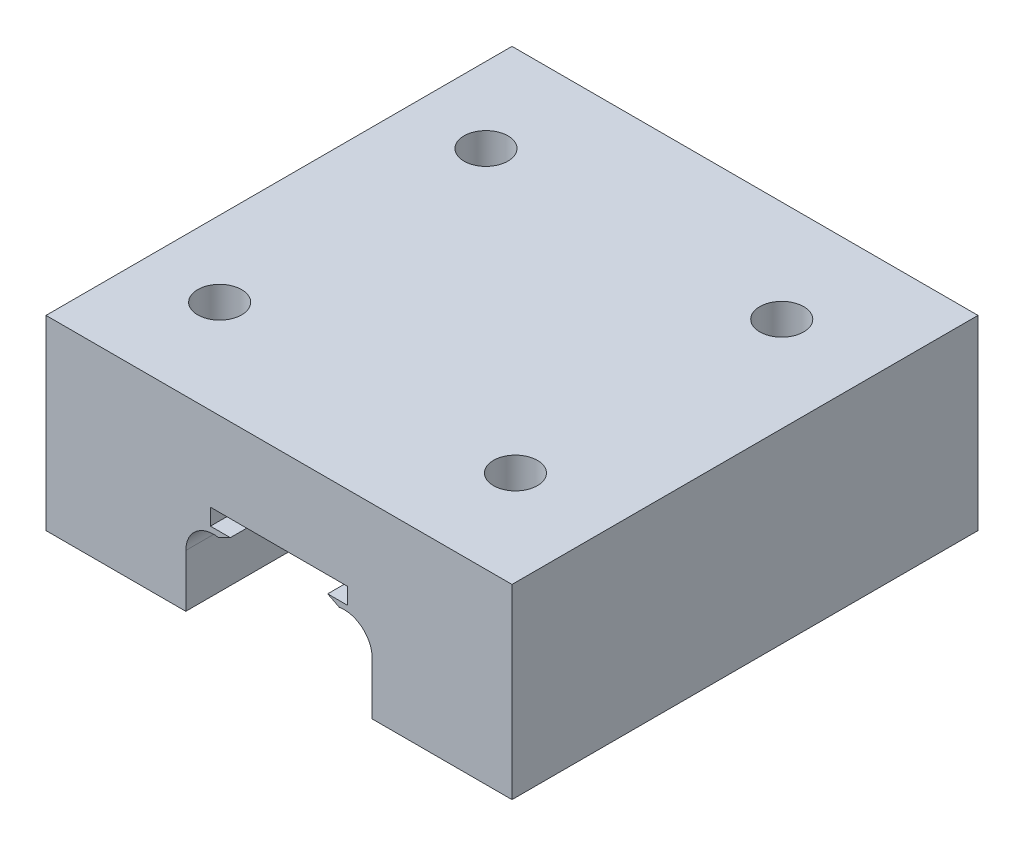
ISO-10303-21;
HEADER;
FILE_DESCRIPTION(('STEP AP214'),'2;1');
FILE_NAME('part.step','',(''),(''),'','','');
FILE_SCHEMA(('AUTOMOTIVE_DESIGN { 1 0 10303 214 1 1 1 1 }'));
ENDSEC;
DATA;
#1=APPLICATION_CONTEXT('core data for automotive mechanical design processes');
#2=APPLICATION_PROTOCOL_DEFINITION('international standard','automotive_design',2000,#1);
#3=PRODUCT_CONTEXT('',#1,'mechanical');
#4=PRODUCT('Part','Part','',(#3));
#5=PRODUCT_RELATED_PRODUCT_CATEGORY('part','',(#4));
#6=PRODUCT_DEFINITION_FORMATION('','',#4);
#7=PRODUCT_DEFINITION_CONTEXT('part definition',#1,'design');
#8=PRODUCT_DEFINITION('design','',#6,#7);
#9=PRODUCT_DEFINITION_SHAPE('','',#8);
#10=(LENGTH_UNIT() NAMED_UNIT(*) SI_UNIT(.MILLI.,.METRE.));
#11=(NAMED_UNIT(*) PLANE_ANGLE_UNIT() SI_UNIT($,.RADIAN.));
#12=(NAMED_UNIT(*) SI_UNIT($,.STERADIAN.) SOLID_ANGLE_UNIT());
#13=UNCERTAINTY_MEASURE_WITH_UNIT(LENGTH_MEASURE(1.E-05),#10,'distance_accuracy_value','');
#14=(GEOMETRIC_REPRESENTATION_CONTEXT(3) GLOBAL_UNCERTAINTY_ASSIGNED_CONTEXT((#13)) GLOBAL_UNIT_ASSIGNED_CONTEXT((#10,
#11,#12)) REPRESENTATION_CONTEXT('',''));
#15=CARTESIAN_POINT('',(0.,0.,0.));
#16=DIRECTION('',(0.,0.,1.));
#17=DIRECTION('',(1.,0.,0.));
#18=AXIS2_PLACEMENT_3D('',#15,#16,#17);
#19=CARTESIAN_POINT('',(-25.,0.,50.));
#20=DIRECTION('',(-1.,0.,0.));
#21=DIRECTION('',(0.,-1.,0.));
#22=AXIS2_PLACEMENT_3D('',#19,#20,#21);
#23=PLANE('',#22);
#24=DIRECTION('',(0.,1.,0.));
#25=VECTOR('',#24,1.);
#26=CARTESIAN_POINT('',(-25.,0.,0.));
#27=LINE('',#26,#25);
#28=CARTESIAN_POINT('',(-25.,0.,0.));
#29=VERTEX_POINT('',#28);
#30=CARTESIAN_POINT('',(-25.,20.,0.));
#31=VERTEX_POINT('',#30);
#32=EDGE_CURVE('E179',#29,#31,#27,.T.);
#33=ORIENTED_EDGE('',*,*,#32,.F.);
#34=DIRECTION('',(0.,0.,-1.));
#35=VECTOR('',#34,1.);
#36=CARTESIAN_POINT('',(-25.,0.,50.));
#37=LINE('',#36,#35);
#38=CARTESIAN_POINT('',(-25.,0.,50.));
#39=VERTEX_POINT('',#38);
#40=EDGE_CURVE('E11',#39,#29,#37,.T.);
#41=ORIENTED_EDGE('',*,*,#40,.F.);
#42=DIRECTION('',(0.,1.,0.));
#43=VECTOR('',#42,1.);
#44=CARTESIAN_POINT('',(-25.,0.,50.));
#45=LINE('',#44,#43);
#46=CARTESIAN_POINT('',(-25.,20.,50.));
#47=VERTEX_POINT('',#46);
#48=EDGE_CURVE('E218',#39,#47,#45,.T.);
#49=ORIENTED_EDGE('',*,*,#48,.T.);
#50=DIRECTION('',(0.,0.,-1.));
#51=VECTOR('',#50,1.);
#52=CARTESIAN_POINT('',(-25.,20.,50.));
#53=LINE('',#52,#51);
#54=EDGE_CURVE('E36',#47,#31,#53,.T.);
#55=ORIENTED_EDGE('',*,*,#54,.T.);
#56=EDGE_LOOP('',(#33,#41,#49,#55));
#57=FACE_BOUND('',#56,.T.);
#58=ADVANCED_FACE('F33',(#57),#23,.T.);
#59=CARTESIAN_POINT('',(-25.,0.,50.));
#60=DIRECTION('',(0.,1.,0.));
#61=DIRECTION('',(-1.,0.,0.));
#62=AXIS2_PLACEMENT_3D('',#59,#60,#61);
#63=PLANE('',#62);
#64=CARTESIAN_POINT('',(-16.9044142875379,0.,10.8891024318751));
#65=DIRECTION('',(0.,1.,0.));
#66=DIRECTION('',(-1.,0.,0.));
#67=AXIS2_PLACEMENT_3D('',#64,#65,#66);
#68=CIRCLE('',#67,2.35674785049616);
#69=CARTESIAN_POINT('',(-19.261162138034,0.,10.8891024318751));
#70=VERTEX_POINT('',#69);
#71=EDGE_CURVE('E308',#70,#70,#68,.T.);
#72=ORIENTED_EDGE('',*,*,#71,.T.);
#73=EDGE_LOOP('',(#72));
#74=FACE_BOUND('',#73,.T.);
#75=CARTESIAN_POINT('',(-16.9044142875379,0.,39.4617841158151));
#76=DIRECTION('',(0.,1.,0.));
#77=DIRECTION('',(-1.,0.,0.));
#78=AXIS2_PLACEMENT_3D('',#75,#76,#77);
#79=CIRCLE('',#78,2.35674785049615);
#80=CARTESIAN_POINT('',(-19.261162138034,0.,39.4617841158151));
#81=VERTEX_POINT('',#80);
#82=EDGE_CURVE('E302',#81,#81,#79,.T.);
#83=ORIENTED_EDGE('',*,*,#82,.T.);
#84=EDGE_LOOP('',(#83));
#85=FACE_BOUND('',#84,.T.);
#86=DIRECTION('',(1.,0.,0.));
#87=VECTOR('',#86,1.);
#88=CARTESIAN_POINT('',(-25.,0.,0.));
#89=LINE('',#88,#87);
#90=CARTESIAN_POINT('',(-10.,0.,0.));
#91=VERTEX_POINT('',#90);
#92=EDGE_CURVE('E102',#29,#91,#89,.T.);
#93=ORIENTED_EDGE('',*,*,#92,.T.);
#94=DIRECTION('',(0.,0.,-1.));
#95=VECTOR('',#94,1.);
#96=CARTESIAN_POINT('',(-10.,0.,50.));
#97=LINE('',#96,#95);
#98=CARTESIAN_POINT('',(-10.,0.,50.));
#99=VERTEX_POINT('',#98);
#100=EDGE_CURVE('E42',#99,#91,#97,.T.);
#101=ORIENTED_EDGE('',*,*,#100,.F.);
#102=DIRECTION('',(1.,0.,0.));
#103=VECTOR('',#102,1.);
#104=CARTESIAN_POINT('',(-25.,0.,50.));
#105=LINE('',#104,#103);
#106=EDGE_CURVE('E157',#39,#99,#105,.T.);
#107=ORIENTED_EDGE('',*,*,#106,.F.);
#108=ORIENTED_EDGE('',*,*,#40,.T.);
#109=EDGE_LOOP('',(#93,#101,#107,#108));
#110=FACE_BOUND('',#109,.T.);
#111=ADVANCED_FACE('F317',(#74,#85,#110),#63,.F.);
#112=CARTESIAN_POINT('',(-10.,0.,50.));
#113=DIRECTION('',(-1.,0.,0.));
#114=DIRECTION('',(0.,0.,1.));
#115=AXIS2_PLACEMENT_3D('',#112,#113,#114);
#116=PLANE('',#115);
#117=DIRECTION('',(0.,1.,0.));
#118=VECTOR('',#117,1.);
#119=CARTESIAN_POINT('',(-10.,0.,0.));
#120=LINE('',#119,#118);
#121=CARTESIAN_POINT('',(-10.,5.65605635574879,0.));
#122=VERTEX_POINT('',#121);
#123=EDGE_CURVE('E164',#91,#122,#120,.T.);
#124=ORIENTED_EDGE('',*,*,#123,.T.);
#125=DIRECTION('',(0.,0.,-1.));
#126=VECTOR('',#125,1.);
#127=CARTESIAN_POINT('',(-10.,5.65605635574879,50.));
#128=LINE('',#127,#126);
#129=CARTESIAN_POINT('',(-10.,5.65605635574879,50.));
#130=VERTEX_POINT('',#129);
#131=EDGE_CURVE('E161',#130,#122,#128,.T.);
#132=ORIENTED_EDGE('',*,*,#131,.F.);
#133=DIRECTION('',(0.,1.,0.));
#134=VECTOR('',#133,1.);
#135=CARTESIAN_POINT('',(-10.,0.,50.));
#136=LINE('',#135,#134);
#137=EDGE_CURVE('E150',#99,#130,#136,.T.);
#138=ORIENTED_EDGE('',*,*,#137,.F.);
#139=ORIENTED_EDGE('',*,*,#100,.T.);
#140=EDGE_LOOP('',(#124,#132,#138,#139));
#141=FACE_BOUND('',#140,.T.);
#142=ADVANCED_FACE('F162',(#141),#116,.F.);
#143=CARTESIAN_POINT('',(-7.00000000000001,5.65605635574879,50.));
#144=DIRECTION('',(0.,0.,-1.));
#145=DIRECTION('',(-1.,0.,0.));
#146=AXIS2_PLACEMENT_3D('',#143,#144,#145);
#147=CYLINDRICAL_SURFACE('',#146,3.);
#148=CARTESIAN_POINT('',(-7.00000000000001,5.65605635574879,0.));
#149=DIRECTION('',(0.,0.,-1.));
#150=DIRECTION('',(-1.,0.,0.));
#151=AXIS2_PLACEMENT_3D('',#148,#149,#150);
#152=CIRCLE('',#151,3.);
#153=CARTESIAN_POINT('',(-6.46154287587818,8.60733809856537,0.));
#154=VERTEX_POINT('',#153);
#155=EDGE_CURVE('E215',#122,#154,#152,.T.);
#156=ORIENTED_EDGE('',*,*,#155,.T.);
#157=DIRECTION('',(0.,0.,-1.));
#158=VECTOR('',#157,1.);
#159=CARTESIAN_POINT('',(-6.46154287587818,8.60733809856537,50.));
#160=LINE('',#159,#158);
#161=CARTESIAN_POINT('',(-6.46154287587818,8.60733809856537,50.));
#162=VERTEX_POINT('',#161);
#163=EDGE_CURVE('E167',#162,#154,#160,.T.);
#164=ORIENTED_EDGE('',*,*,#163,.F.);
#165=CARTESIAN_POINT('',(-7.00000000000001,5.65605635574879,50.));
#166=DIRECTION('',(0.,0.,-1.));
#167=DIRECTION('',(-1.,0.,0.));
#168=AXIS2_PLACEMENT_3D('',#165,#166,#167);
#169=CIRCLE('',#168,3.);
#170=EDGE_CURVE('E155',#130,#162,#169,.T.);
#171=ORIENTED_EDGE('',*,*,#170,.F.);
#172=ORIENTED_EDGE('',*,*,#131,.T.);
#173=EDGE_LOOP('',(#156,#164,#171,#172));
#174=FACE_BOUND('',#173,.T.);
#175=ADVANCED_FACE('F169',(#174),#147,.F.);
#176=CARTESIAN_POINT('',(-6.46154287587818,8.60733809856537,50.));
#177=DIRECTION('',(-0.452765463645249,0.891629651217422,0.));
#178=DIRECTION('',(-0.891629651217423,-0.45276546364525,0.));
#179=AXIS2_PLACEMENT_3D('',#176,#177,#178);
#180=PLANE('',#179);
#181=DIRECTION('',(0.891629651217423,0.45276546364525,0.));
#182=VECTOR('',#181,1.);
#183=CARTESIAN_POINT('',(-6.46154287587818,8.60733809856537,0.));
#184=LINE('',#183,#182);
#185=CARTESIAN_POINT('',(-5.22174404276978,9.2369022822292,0.));
#186=VERTEX_POINT('',#185);
#187=EDGE_CURVE('E213',#154,#186,#184,.T.);
#188=ORIENTED_EDGE('',*,*,#187,.T.);
#189=DIRECTION('',(0.,0.,-1.));
#190=VECTOR('',#189,1.);
#191=CARTESIAN_POINT('',(-5.22174404276978,9.2369022822292,50.));
#192=LINE('',#191,#190);
#193=CARTESIAN_POINT('',(-5.22174404276978,9.2369022822292,50.));
#194=VERTEX_POINT('',#193);
#195=EDGE_CURVE('E222',#194,#186,#192,.T.);
#196=ORIENTED_EDGE('',*,*,#195,.F.);
#197=DIRECTION('',(0.891629651217423,0.45276546364525,0.));
#198=VECTOR('',#197,1.);
#199=CARTESIAN_POINT('',(-6.46154287587818,8.60733809856537,50.));
#200=LINE('',#199,#198);
#201=EDGE_CURVE('E172',#162,#194,#200,.T.);
#202=ORIENTED_EDGE('',*,*,#201,.F.);
#203=ORIENTED_EDGE('',*,*,#163,.T.);
#204=EDGE_LOOP('',(#188,#196,#202,#203));
#205=FACE_BOUND('',#204,.T.);
#206=ADVANCED_FACE('F254',(#205),#180,.F.);
#207=CARTESIAN_POINT('',(-5.22174404276978,9.2369022822292,50.));
#208=DIRECTION('',(0.,-1.,0.));
#209=DIRECTION('',(1.,0.,0.));
#210=AXIS2_PLACEMENT_3D('',#207,#208,#209);
#211=PLANE('',#210);
#212=DIRECTION('',(-1.,0.,0.));
#213=VECTOR('',#212,1.);
#214=CARTESIAN_POINT('',(-5.22174404276978,9.2369022822292,0.));
#215=LINE('',#214,#213);
#216=CARTESIAN_POINT('',(-7.35481869295251,9.2369022822292,0.));
#217=VERTEX_POINT('',#216);
#218=EDGE_CURVE('E211',#186,#217,#215,.T.);
#219=ORIENTED_EDGE('',*,*,#218,.T.);
#220=DIRECTION('',(0.,0.,-1.));
#221=VECTOR('',#220,1.);
#222=CARTESIAN_POINT('',(-7.35481869295251,9.2369022822292,50.));
#223=LINE('',#222,#221);
#224=CARTESIAN_POINT('',(-7.35481869295251,9.2369022822292,50.));
#225=VERTEX_POINT('',#224);
#226=EDGE_CURVE('E225',#225,#217,#223,.T.);
#227=ORIENTED_EDGE('',*,*,#226,.F.);
#228=DIRECTION('',(-1.,0.,0.));
#229=VECTOR('',#228,1.);
#230=CARTESIAN_POINT('',(-5.22174404276978,9.2369022822292,50.));
#231=LINE('',#230,#229);
#232=EDGE_CURVE('E174',#194,#225,#231,.T.);
#233=ORIENTED_EDGE('',*,*,#232,.F.);
#234=ORIENTED_EDGE('',*,*,#195,.T.);
#235=EDGE_LOOP('',(#219,#227,#233,#234));
#236=FACE_BOUND('',#235,.T.);
#237=ADVANCED_FACE('F262',(#236),#211,.F.);
#238=CARTESIAN_POINT('',(-7.35481869295251,9.2369022822292,50.));
#239=DIRECTION('',(-1.,0.,0.));
#240=DIRECTION('',(0.,0.,1.));
#241=AXIS2_PLACEMENT_3D('',#238,#239,#240);
#242=PLANE('',#241);
#243=DIRECTION('',(0.,1.,0.));
#244=VECTOR('',#243,1.);
#245=CARTESIAN_POINT('',(-7.35481869295251,9.2369022822292,0.));
#246=LINE('',#245,#244);
#247=CARTESIAN_POINT('',(-7.35481869295251,11.,0.));
#248=VERTEX_POINT('',#247);
#249=EDGE_CURVE('E209',#217,#248,#246,.T.);
#250=ORIENTED_EDGE('',*,*,#249,.T.);
#251=DIRECTION('',(0.,0.,-1.));
#252=VECTOR('',#251,1.);
#253=CARTESIAN_POINT('',(-7.35481869295251,11.,50.));
#254=LINE('',#253,#252);
#255=CARTESIAN_POINT('',(-7.35481869295251,11.,50.));
#256=VERTEX_POINT('',#255);
#257=EDGE_CURVE('E228',#256,#248,#254,.T.);
#258=ORIENTED_EDGE('',*,*,#257,.F.);
#259=DIRECTION('',(0.,1.,0.));
#260=VECTOR('',#259,1.);
#261=CARTESIAN_POINT('',(-7.35481869295251,9.2369022822292,50.));
#262=LINE('',#261,#260);
#263=EDGE_CURVE('E259',#225,#256,#262,.T.);
#264=ORIENTED_EDGE('',*,*,#263,.F.);
#265=ORIENTED_EDGE('',*,*,#226,.T.);
#266=EDGE_LOOP('',(#250,#258,#264,#265));
#267=FACE_BOUND('',#266,.T.);
#268=ADVANCED_FACE('F265',(#267),#242,.F.);
#269=CARTESIAN_POINT('',(-7.35481869295251,11.,50.));
#270=DIRECTION('',(0.,1.,0.));
#271=DIRECTION('',(-1.,0.,0.));
#272=AXIS2_PLACEMENT_3D('',#269,#270,#271);
#273=PLANE('',#272);
#274=DIRECTION('',(1.,0.,0.));
#275=VECTOR('',#274,1.);
#276=CARTESIAN_POINT('',(-7.35481869295251,11.,0.));
#277=LINE('',#276,#275);
#278=CARTESIAN_POINT('',(7.35481869295251,11.,0.));
#279=VERTEX_POINT('',#278);
#280=EDGE_CURVE('E206',#248,#279,#277,.T.);
#281=ORIENTED_EDGE('',*,*,#280,.T.);
#282=DIRECTION('',(0.,0.,-1.));
#283=VECTOR('',#282,1.);
#284=CARTESIAN_POINT('',(7.35481869295251,11.,50.));
#285=LINE('',#284,#283);
#286=CARTESIAN_POINT('',(7.35481869295251,11.,50.));
#287=VERTEX_POINT('',#286);
#288=EDGE_CURVE('E231',#287,#279,#285,.T.);
#289=ORIENTED_EDGE('',*,*,#288,.F.);
#290=DIRECTION('',(1.,0.,0.));
#291=VECTOR('',#290,1.);
#292=CARTESIAN_POINT('',(-7.35481869295251,11.,50.));
#293=LINE('',#292,#291);
#294=EDGE_CURVE('E267',#256,#287,#293,.T.);
#295=ORIENTED_EDGE('',*,*,#294,.F.);
#296=ORIENTED_EDGE('',*,*,#257,.T.);
#297=EDGE_LOOP('',(#281,#289,#295,#296));
#298=FACE_BOUND('',#297,.T.);
#299=ADVANCED_FACE('F368',(#298),#273,.F.);
#300=CARTESIAN_POINT('',(7.35481869295251,9.2369022822292,50.));
#301=DIRECTION('',(-1.,0.,0.));
#302=DIRECTION('',(0.,0.,1.));
#303=AXIS2_PLACEMENT_3D('',#300,#301,#302);
#304=PLANE('',#303);
#305=DIRECTION('',(0.,1.,0.));
#306=VECTOR('',#305,1.);
#307=CARTESIAN_POINT('',(7.35481869295251,9.2369022822292,0.));
#308=LINE('',#307,#306);
#309=CARTESIAN_POINT('',(7.35481869295251,9.2369022822292,0.));
#310=VERTEX_POINT('',#309);
#311=EDGE_CURVE('E203',#310,#279,#308,.T.);
#312=ORIENTED_EDGE('',*,*,#311,.F.);
#313=DIRECTION('',(0.,0.,-1.));
#314=VECTOR('',#313,1.);
#315=CARTESIAN_POINT('',(7.35481869295251,9.2369022822292,50.));
#316=LINE('',#315,#314);
#317=CARTESIAN_POINT('',(7.35481869295251,9.2369022822292,50.));
#318=VERTEX_POINT('',#317);
#319=EDGE_CURVE('E233',#318,#310,#316,.T.);
#320=ORIENTED_EDGE('',*,*,#319,.F.);
#321=DIRECTION('',(0.,1.,0.));
#322=VECTOR('',#321,1.);
#323=CARTESIAN_POINT('',(7.35481869295251,9.2369022822292,50.));
#324=LINE('',#323,#322);
#325=EDGE_CURVE('E269',#318,#287,#324,.T.);
#326=ORIENTED_EDGE('',*,*,#325,.T.);
#327=ORIENTED_EDGE('',*,*,#288,.T.);
#328=EDGE_LOOP('',(#312,#320,#326,#327));
#329=FACE_BOUND('',#328,.T.);
#330=ADVANCED_FACE('F371',(#329),#304,.T.);
#331=CARTESIAN_POINT('',(5.22174404276978,9.2369022822292,50.));
#332=DIRECTION('',(0.,1.,0.));
#333=DIRECTION('',(-1.,0.,0.));
#334=AXIS2_PLACEMENT_3D('',#331,#332,#333);
#335=PLANE('',#334);
#336=DIRECTION('',(1.,0.,0.));
#337=VECTOR('',#336,1.);
#338=CARTESIAN_POINT('',(5.22174404276978,9.2369022822292,0.));
#339=LINE('',#338,#337);
#340=CARTESIAN_POINT('',(5.22174404276978,9.2369022822292,0.));
#341=VERTEX_POINT('',#340);
#342=EDGE_CURVE('E200',#341,#310,#339,.T.);
#343=ORIENTED_EDGE('',*,*,#342,.F.);
#344=DIRECTION('',(0.,0.,-1.));
#345=VECTOR('',#344,1.);
#346=CARTESIAN_POINT('',(5.22174404276978,9.2369022822292,50.));
#347=LINE('',#346,#345);
#348=CARTESIAN_POINT('',(5.22174404276978,9.2369022822292,50.));
#349=VERTEX_POINT('',#348);
#350=EDGE_CURVE('E235',#349,#341,#347,.T.);
#351=ORIENTED_EDGE('',*,*,#350,.F.);
#352=DIRECTION('',(1.,0.,0.));
#353=VECTOR('',#352,1.);
#354=CARTESIAN_POINT('',(5.22174404276978,9.2369022822292,50.));
#355=LINE('',#354,#353);
#356=EDGE_CURVE('E274',#349,#318,#355,.T.);
#357=ORIENTED_EDGE('',*,*,#356,.T.);
#358=ORIENTED_EDGE('',*,*,#319,.T.);
#359=EDGE_LOOP('',(#343,#351,#357,#358));
#360=FACE_BOUND('',#359,.T.);
#361=ADVANCED_FACE('F375',(#360),#335,.T.);
#362=CARTESIAN_POINT('',(6.46154287587818,8.60733809856537,50.));
#363=DIRECTION('',(-0.452765463645249,-0.891629651217422,0.));
#364=DIRECTION('',(0.891629651217423,-0.45276546364525,0.));
#365=AXIS2_PLACEMENT_3D('',#362,#363,#364);
#366=PLANE('',#365);
#367=DIRECTION('',(-0.891629651217423,0.45276546364525,0.));
#368=VECTOR('',#367,1.);
#369=CARTESIAN_POINT('',(6.46154287587818,8.60733809856537,0.));
#370=LINE('',#369,#368);
#371=CARTESIAN_POINT('',(6.46154287587818,8.60733809856537,0.));
#372=VERTEX_POINT('',#371);
#373=EDGE_CURVE('E197',#372,#341,#370,.T.);
#374=ORIENTED_EDGE('',*,*,#373,.F.);
#375=DIRECTION('',(0.,0.,-1.));
#376=VECTOR('',#375,1.);
#377=CARTESIAN_POINT('',(6.46154287587818,8.60733809856537,50.));
#378=LINE('',#377,#376);
#379=CARTESIAN_POINT('',(6.46154287587818,8.60733809856537,50.));
#380=VERTEX_POINT('',#379);
#381=EDGE_CURVE('E237',#380,#372,#378,.T.);
#382=ORIENTED_EDGE('',*,*,#381,.F.);
#383=DIRECTION('',(-0.891629651217423,0.45276546364525,0.));
#384=VECTOR('',#383,1.);
#385=CARTESIAN_POINT('',(6.46154287587818,8.60733809856537,50.));
#386=LINE('',#385,#384);
#387=EDGE_CURVE('E277',#380,#349,#386,.T.);
#388=ORIENTED_EDGE('',*,*,#387,.T.);
#389=ORIENTED_EDGE('',*,*,#350,.T.);
#390=EDGE_LOOP('',(#374,#382,#388,#389));
#391=FACE_BOUND('',#390,.T.);
#392=ADVANCED_FACE('F379',(#391),#366,.T.);
#393=CARTESIAN_POINT('',(7.00000000000001,5.65605635574879,50.));
#394=DIRECTION('',(0.,0.,-1.));
#395=DIRECTION('',(-1.,0.,0.));
#396=AXIS2_PLACEMENT_3D('',#393,#394,#395);
#397=CYLINDRICAL_SURFACE('',#396,3.);
#398=CARTESIAN_POINT('',(7.00000000000001,5.65605635574879,0.));
#399=DIRECTION('',(0.,0.,1.));
#400=DIRECTION('',(1.,0.,0.));
#401=AXIS2_PLACEMENT_3D('',#398,#399,#400);
#402=CIRCLE('',#401,3.);
#403=CARTESIAN_POINT('',(10.,5.65605635574879,0.));
#404=VERTEX_POINT('',#403);
#405=EDGE_CURVE('E194',#404,#372,#402,.T.);
#406=ORIENTED_EDGE('',*,*,#405,.F.);
#407=DIRECTION('',(0.,0.,-1.));
#408=VECTOR('',#407,1.);
#409=CARTESIAN_POINT('',(10.,5.65605635574879,50.));
#410=LINE('',#409,#408);
#411=CARTESIAN_POINT('',(10.,5.65605635574879,50.));
#412=VERTEX_POINT('',#411);
#413=EDGE_CURVE('E239',#412,#404,#410,.T.);
#414=ORIENTED_EDGE('',*,*,#413,.F.);
#415=CARTESIAN_POINT('',(7.00000000000001,5.65605635574879,50.));
#416=DIRECTION('',(0.,0.,1.));
#417=DIRECTION('',(1.,0.,0.));
#418=AXIS2_PLACEMENT_3D('',#415,#416,#417);
#419=CIRCLE('',#418,3.);
#420=EDGE_CURVE('E280',#412,#380,#419,.T.);
#421=ORIENTED_EDGE('',*,*,#420,.T.);
#422=ORIENTED_EDGE('',*,*,#381,.T.);
#423=EDGE_LOOP('',(#406,#414,#421,#422));
#424=FACE_BOUND('',#423,.T.);
#425=ADVANCED_FACE('F383',(#424),#397,.F.);
#426=CARTESIAN_POINT('',(10.,0.,50.));
#427=DIRECTION('',(-1.,0.,0.));
#428=DIRECTION('',(0.,-1.,0.));
#429=AXIS2_PLACEMENT_3D('',#426,#427,#428);
#430=PLANE('',#429);
#431=DIRECTION('',(0.,1.,0.));
#432=VECTOR('',#431,1.);
#433=CARTESIAN_POINT('',(10.,0.,0.));
#434=LINE('',#433,#432);
#435=CARTESIAN_POINT('',(10.,0.,0.));
#436=VERTEX_POINT('',#435);
#437=EDGE_CURVE('E191',#436,#404,#434,.T.);
#438=ORIENTED_EDGE('',*,*,#437,.F.);
#439=DIRECTION('',(0.,0.,-1.));
#440=VECTOR('',#439,1.);
#441=CARTESIAN_POINT('',(10.,0.,50.));
#442=LINE('',#441,#440);
#443=CARTESIAN_POINT('',(10.,0.,50.));
#444=VERTEX_POINT('',#443);
#445=EDGE_CURVE('E241',#444,#436,#442,.T.);
#446=ORIENTED_EDGE('',*,*,#445,.F.);
#447=DIRECTION('',(0.,1.,0.));
#448=VECTOR('',#447,1.);
#449=CARTESIAN_POINT('',(10.,0.,50.));
#450=LINE('',#449,#448);
#451=EDGE_CURVE('E283',#444,#412,#450,.T.);
#452=ORIENTED_EDGE('',*,*,#451,.T.);
#453=ORIENTED_EDGE('',*,*,#413,.T.);
#454=EDGE_LOOP('',(#438,#446,#452,#453));
#455=FACE_BOUND('',#454,.T.);
#456=ADVANCED_FACE('F387',(#455),#430,.T.);
#457=CARTESIAN_POINT('',(10.,0.,50.));
#458=DIRECTION('',(0.,1.,0.));
#459=DIRECTION('',(-1.,0.,0.));
#460=AXIS2_PLACEMENT_3D('',#457,#458,#459);
#461=PLANE('',#460);
#462=CARTESIAN_POINT('',(14.83186667555,0.,39.4617841158151));
#463=DIRECTION('',(0.,1.,0.));
#464=DIRECTION('',(-1.,0.,0.));
#465=AXIS2_PLACEMENT_3D('',#462,#463,#464);
#466=CIRCLE('',#465,2.35674785049616);
#467=CARTESIAN_POINT('',(12.4751188250539,0.,39.4617841158151));
#468=VERTEX_POINT('',#467);
#469=EDGE_CURVE('E296',#468,#468,#466,.T.);
#470=ORIENTED_EDGE('',*,*,#469,.T.);
#471=EDGE_LOOP('',(#470));
#472=FACE_BOUND('',#471,.T.);
#473=CARTESIAN_POINT('',(14.83186667555,0.,10.8891024318751));
#474=DIRECTION('',(0.,1.,0.));
#475=DIRECTION('',(-1.,0.,0.));
#476=AXIS2_PLACEMENT_3D('',#473,#474,#475);
#477=CIRCLE('',#476,2.35674785049616);
#478=CARTESIAN_POINT('',(12.4751188250539,0.,10.8891024318751));
#479=VERTEX_POINT('',#478);
#480=EDGE_CURVE('E183',#479,#479,#477,.T.);
#481=ORIENTED_EDGE('',*,*,#480,.T.);
#482=EDGE_LOOP('',(#481));
#483=FACE_BOUND('',#482,.T.);
#484=DIRECTION('',(1.,0.,0.));
#485=VECTOR('',#484,1.);
#486=CARTESIAN_POINT('',(10.,0.,0.));
#487=LINE('',#486,#485);
#488=CARTESIAN_POINT('',(25.,0.,0.));
#489=VERTEX_POINT('',#488);
#490=EDGE_CURVE('E189',#436,#489,#487,.T.);
#491=ORIENTED_EDGE('',*,*,#490,.T.);
#492=DIRECTION('',(0.,0.,-1.));
#493=VECTOR('',#492,1.);
#494=CARTESIAN_POINT('',(25.,0.,50.));
#495=LINE('',#494,#493);
#496=CARTESIAN_POINT('',(25.,0.,50.));
#497=VERTEX_POINT('',#496);
#498=EDGE_CURVE('E243',#497,#489,#495,.T.);
#499=ORIENTED_EDGE('',*,*,#498,.F.);
#500=DIRECTION('',(1.,0.,0.));
#501=VECTOR('',#500,1.);
#502=CARTESIAN_POINT('',(10.,0.,50.));
#503=LINE('',#502,#501);
#504=EDGE_CURVE('E286',#444,#497,#503,.T.);
#505=ORIENTED_EDGE('',*,*,#504,.F.);
#506=ORIENTED_EDGE('',*,*,#445,.T.);
#507=EDGE_LOOP('',(#491,#499,#505,#506));
#508=FACE_BOUND('',#507,.T.);
#509=ADVANCED_FACE('F391',(#472,#483,#508),#461,.F.);
#510=CARTESIAN_POINT('',(25.,0.,50.));
#511=DIRECTION('',(-1.,0.,0.));
#512=DIRECTION('',(0.,-1.,0.));
#513=AXIS2_PLACEMENT_3D('',#510,#511,#512);
#514=PLANE('',#513);
#515=DIRECTION('',(0.,1.,0.));
#516=VECTOR('',#515,1.);
#517=CARTESIAN_POINT('',(25.,0.,0.));
#518=LINE('',#517,#516);
#519=CARTESIAN_POINT('',(25.,20.,0.));
#520=VERTEX_POINT('',#519);
#521=EDGE_CURVE('E186',#489,#520,#518,.T.);
#522=ORIENTED_EDGE('',*,*,#521,.T.);
#523=DIRECTION('',(0.,0.,-1.));
#524=VECTOR('',#523,1.);
#525=CARTESIAN_POINT('',(25.,20.,50.));
#526=LINE('',#525,#524);
#527=CARTESIAN_POINT('',(25.,20.,50.));
#528=VERTEX_POINT('',#527);
#529=EDGE_CURVE('E245',#528,#520,#526,.T.);
#530=ORIENTED_EDGE('',*,*,#529,.F.);
#531=DIRECTION('',(0.,1.,0.));
#532=VECTOR('',#531,1.);
#533=CARTESIAN_POINT('',(25.,0.,50.));
#534=LINE('',#533,#532);
#535=EDGE_CURVE('E288',#497,#528,#534,.T.);
#536=ORIENTED_EDGE('',*,*,#535,.F.);
#537=ORIENTED_EDGE('',*,*,#498,.T.);
#538=EDGE_LOOP('',(#522,#530,#536,#537));
#539=FACE_BOUND('',#538,.T.);
#540=ADVANCED_FACE('F329',(#539),#514,.F.);
#541=CARTESIAN_POINT('',(-25.,20.,50.));
#542=DIRECTION('',(0.,1.,0.));
#543=DIRECTION('',(-1.,0.,0.));
#544=AXIS2_PLACEMENT_3D('',#541,#542,#543);
#545=PLANE('',#544);
#546=CARTESIAN_POINT('',(-16.9044142875379,20.,10.8891024318751));
#547=DIRECTION('',(0.,1.,0.));
#548=DIRECTION('',(-1.,0.,0.));
#549=AXIS2_PLACEMENT_3D('',#546,#547,#548);
#550=CIRCLE('',#549,2.35674785049616);
#551=CARTESIAN_POINT('',(-19.261162138034,20.,10.8891024318751));
#552=VERTEX_POINT('',#551);
#553=EDGE_CURVE('E311',#552,#552,#550,.T.);
#554=ORIENTED_EDGE('',*,*,#553,.F.);
#555=EDGE_LOOP('',(#554));
#556=FACE_BOUND('',#555,.T.);
#557=CARTESIAN_POINT('',(-16.9044142875379,20.,39.4617841158151));
#558=DIRECTION('',(0.,1.,0.));
#559=DIRECTION('',(-1.,0.,0.));
#560=AXIS2_PLACEMENT_3D('',#557,#558,#559);
#561=CIRCLE('',#560,2.35674785049615);
#562=CARTESIAN_POINT('',(-19.261162138034,20.,39.4617841158151));
#563=VERTEX_POINT('',#562);
#564=EDGE_CURVE('E305',#563,#563,#561,.T.);
#565=ORIENTED_EDGE('',*,*,#564,.F.);
#566=EDGE_LOOP('',(#565));
#567=FACE_BOUND('',#566,.T.);
#568=CARTESIAN_POINT('',(14.83186667555,20.,39.4617841158151));
#569=DIRECTION('',(0.,1.,0.));
#570=DIRECTION('',(-1.,0.,0.));
#571=AXIS2_PLACEMENT_3D('',#568,#569,#570);
#572=CIRCLE('',#571,2.35674785049616);
#573=CARTESIAN_POINT('',(12.4751188250539,20.,39.4617841158151));
#574=VERTEX_POINT('',#573);
#575=EDGE_CURVE('E299',#574,#574,#572,.T.);
#576=ORIENTED_EDGE('',*,*,#575,.F.);
#577=EDGE_LOOP('',(#576));
#578=FACE_BOUND('',#577,.T.);
#579=CARTESIAN_POINT('',(14.83186667555,20.,10.8891024318751));
#580=DIRECTION('',(0.,1.,0.));
#581=DIRECTION('',(-1.,0.,0.));
#582=AXIS2_PLACEMENT_3D('',#579,#580,#581);
#583=CIRCLE('',#582,2.35674785049616);
#584=CARTESIAN_POINT('',(12.4751188250539,20.,10.8891024318751));
#585=VERTEX_POINT('',#584);
#586=EDGE_CURVE('E293',#585,#585,#583,.T.);
#587=ORIENTED_EDGE('',*,*,#586,.F.);
#588=EDGE_LOOP('',(#587));
#589=FACE_BOUND('',#588,.T.);
#590=DIRECTION('',(1.,0.,0.));
#591=VECTOR('',#590,1.);
#592=CARTESIAN_POINT('',(-25.,20.,0.));
#593=LINE('',#592,#591);
#594=EDGE_CURVE('E182',#31,#520,#593,.T.);
#595=ORIENTED_EDGE('',*,*,#594,.F.);
#596=ORIENTED_EDGE('',*,*,#54,.F.);
#597=DIRECTION('',(1.,0.,0.));
#598=VECTOR('',#597,1.);
#599=CARTESIAN_POINT('',(-25.,20.,50.));
#600=LINE('',#599,#598);
#601=EDGE_CURVE('E290',#47,#528,#600,.T.);
#602=ORIENTED_EDGE('',*,*,#601,.T.);
#603=ORIENTED_EDGE('',*,*,#529,.T.);
#604=EDGE_LOOP('',(#595,#596,#602,#603));
#605=FACE_BOUND('',#604,.T.);
#606=ADVANCED_FACE('F247',(#556,#567,#578,#589,#605),#545,.T.);
#607=CARTESIAN_POINT('',(7.00000000000001,5.65605635574879,50.));
#608=DIRECTION('',(0.,0.,1.));
#609=DIRECTION('',(1.,0.,0.));
#610=AXIS2_PLACEMENT_3D('',#607,#608,#609);
#611=PLANE('',#610);
#612=ORIENTED_EDGE('',*,*,#48,.F.);
#613=ORIENTED_EDGE('',*,*,#106,.T.);
#614=ORIENTED_EDGE('',*,*,#137,.T.);
#615=ORIENTED_EDGE('',*,*,#170,.T.);
#616=ORIENTED_EDGE('',*,*,#201,.T.);
#617=ORIENTED_EDGE('',*,*,#232,.T.);
#618=ORIENTED_EDGE('',*,*,#263,.T.);
#619=ORIENTED_EDGE('',*,*,#294,.T.);
#620=ORIENTED_EDGE('',*,*,#325,.F.);
#621=ORIENTED_EDGE('',*,*,#356,.F.);
#622=ORIENTED_EDGE('',*,*,#387,.F.);
#623=ORIENTED_EDGE('',*,*,#420,.F.);
#624=ORIENTED_EDGE('',*,*,#451,.F.);
#625=ORIENTED_EDGE('',*,*,#504,.T.);
#626=ORIENTED_EDGE('',*,*,#535,.T.);
#627=ORIENTED_EDGE('',*,*,#601,.F.);
#628=EDGE_LOOP('',(#612,#613,#614,#615,#616,#617,#618,#619,#620,#621,#622,#623,#624,#625,#626,#627));
#629=FACE_BOUND('',#628,.T.);
#630=ADVANCED_FACE('F153',(#629),#611,.T.);
#631=CARTESIAN_POINT('',(7.00000000000001,5.65605635574879,0.));
#632=DIRECTION('',(0.,0.,1.));
#633=DIRECTION('',(1.,0.,0.));
#634=AXIS2_PLACEMENT_3D('',#631,#632,#633);
#635=PLANE('',#634);
#636=ORIENTED_EDGE('',*,*,#32,.T.);
#637=ORIENTED_EDGE('',*,*,#594,.T.);
#638=ORIENTED_EDGE('',*,*,#521,.F.);
#639=ORIENTED_EDGE('',*,*,#490,.F.);
#640=ORIENTED_EDGE('',*,*,#437,.T.);
#641=ORIENTED_EDGE('',*,*,#405,.T.);
#642=ORIENTED_EDGE('',*,*,#373,.T.);
#643=ORIENTED_EDGE('',*,*,#342,.T.);
#644=ORIENTED_EDGE('',*,*,#311,.T.);
#645=ORIENTED_EDGE('',*,*,#280,.F.);
#646=ORIENTED_EDGE('',*,*,#249,.F.);
#647=ORIENTED_EDGE('',*,*,#218,.F.);
#648=ORIENTED_EDGE('',*,*,#187,.F.);
#649=ORIENTED_EDGE('',*,*,#155,.F.);
#650=ORIENTED_EDGE('',*,*,#123,.F.);
#651=ORIENTED_EDGE('',*,*,#92,.F.);
#652=EDGE_LOOP('',(#636,#637,#638,#639,#640,#641,#642,#643,#644,#645,#646,#647,#648,#649,#650,#651));
#653=FACE_BOUND('',#652,.T.);
#654=ADVANCED_FACE('F250',(#653),#635,.F.);
#655=CARTESIAN_POINT('',(14.83186667555,0.,10.8891024318751));
#656=DIRECTION('',(0.,1.,0.));
#657=DIRECTION('',(-1.,0.,0.));
#658=AXIS2_PLACEMENT_3D('',#655,#656,#657);
#659=CYLINDRICAL_SURFACE('',#658,2.35674785049616);
#660=ORIENTED_EDGE('',*,*,#480,.F.);
#661=EDGE_LOOP('',(#660));
#662=FACE_BOUND('',#661,.T.);
#663=ORIENTED_EDGE('',*,*,#586,.T.);
#664=EDGE_LOOP('',(#663));
#665=FACE_BOUND('',#664,.T.);
#666=ADVANCED_FACE('F336',(#662,#665),#659,.F.);
#667=CARTESIAN_POINT('',(14.83186667555,0.,39.4617841158151));
#668=DIRECTION('',(0.,1.,0.));
#669=DIRECTION('',(-1.,0.,0.));
#670=AXIS2_PLACEMENT_3D('',#667,#668,#669);
#671=CYLINDRICAL_SURFACE('',#670,2.35674785049616);
#672=ORIENTED_EDGE('',*,*,#469,.F.);
#673=EDGE_LOOP('',(#672));
#674=FACE_BOUND('',#673,.T.);
#675=ORIENTED_EDGE('',*,*,#575,.T.);
#676=EDGE_LOOP('',(#675));
#677=FACE_BOUND('',#676,.T.);
#678=ADVANCED_FACE('F338',(#674,#677),#671,.F.);
#679=CARTESIAN_POINT('',(-16.9044142875379,0.,39.4617841158151));
#680=DIRECTION('',(0.,1.,0.));
#681=DIRECTION('',(-1.,0.,0.));
#682=AXIS2_PLACEMENT_3D('',#679,#680,#681);
#683=CYLINDRICAL_SURFACE('',#682,2.35674785049615);
#684=ORIENTED_EDGE('',*,*,#82,.F.);
#685=EDGE_LOOP('',(#684));
#686=FACE_BOUND('',#685,.T.);
#687=ORIENTED_EDGE('',*,*,#564,.T.);
#688=EDGE_LOOP('',(#687));
#689=FACE_BOUND('',#688,.T.);
#690=ADVANCED_FACE('F323',(#686,#689),#683,.F.);
#691=CARTESIAN_POINT('',(-16.9044142875379,0.,10.8891024318751));
#692=DIRECTION('',(0.,1.,0.));
#693=DIRECTION('',(-1.,0.,0.));
#694=AXIS2_PLACEMENT_3D('',#691,#692,#693);
#695=CYLINDRICAL_SURFACE('',#694,2.35674785049616);
#696=ORIENTED_EDGE('',*,*,#71,.F.);
#697=EDGE_LOOP('',(#696));
#698=FACE_BOUND('',#697,.T.);
#699=ORIENTED_EDGE('',*,*,#553,.T.);
#700=EDGE_LOOP('',(#699));
#701=FACE_BOUND('',#700,.T.);
#702=ADVANCED_FACE('F320',(#698,#701),#695,.F.);
#703=CLOSED_SHELL('',(#58,#111,#142,#175,#206,#237,#268,#299,#330,#361,#392,#425,#456,#509,#540,
#606,#630,#654,#666,#678,#690,#702));
#704=MANIFOLD_SOLID_BREP('B2',#703);
#705=ADVANCED_BREP_SHAPE_REPRESENTATION('',(#18,#704),#14);
#706=SHAPE_DEFINITION_REPRESENTATION(#9,#705);
ENDSEC;
END-ISO-10303-21;
